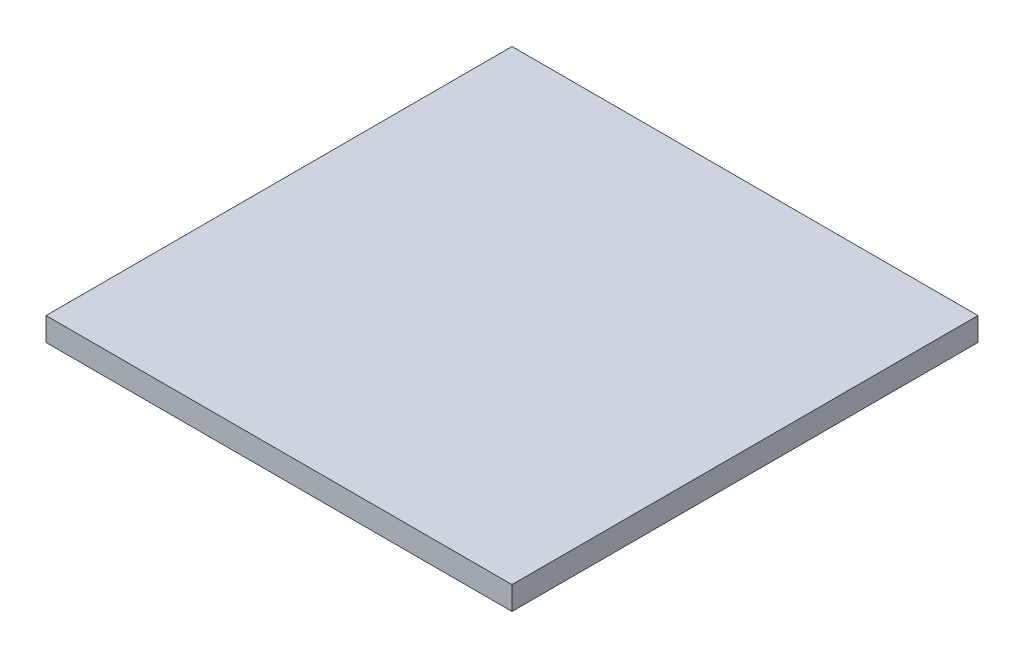
ISO-10303-21;
HEADER;
FILE_DESCRIPTION(('STEP AP214'),'2;1');
FILE_NAME('part.step','',(''),(''),'','','');
FILE_SCHEMA(('AUTOMOTIVE_DESIGN { 1 0 10303 214 1 1 1 1 }'));
ENDSEC;
DATA;
#1=APPLICATION_CONTEXT('core data for automotive mechanical design processes');
#2=APPLICATION_PROTOCOL_DEFINITION('international standard','automotive_design',2000,#1);
#3=PRODUCT_CONTEXT('',#1,'mechanical');
#4=PRODUCT('Part','Part','',(#3));
#5=PRODUCT_RELATED_PRODUCT_CATEGORY('part','',(#4));
#6=PRODUCT_DEFINITION_FORMATION('','',#4);
#7=PRODUCT_DEFINITION_CONTEXT('part definition',#1,'design');
#8=PRODUCT_DEFINITION('design','',#6,#7);
#9=PRODUCT_DEFINITION_SHAPE('','',#8);
#10=(LENGTH_UNIT() NAMED_UNIT(*) SI_UNIT(.MILLI.,.METRE.));
#11=(NAMED_UNIT(*) PLANE_ANGLE_UNIT() SI_UNIT($,.RADIAN.));
#12=(NAMED_UNIT(*) SI_UNIT($,.STERADIAN.) SOLID_ANGLE_UNIT());
#13=UNCERTAINTY_MEASURE_WITH_UNIT(LENGTH_MEASURE(1.E-05),#10,'distance_accuracy_value','');
#14=(GEOMETRIC_REPRESENTATION_CONTEXT(3) GLOBAL_UNCERTAINTY_ASSIGNED_CONTEXT((#13)) GLOBAL_UNIT_ASSIGNED_CONTEXT((#10,
#11,#12)) REPRESENTATION_CONTEXT('',''));
#15=CARTESIAN_POINT('',(0.,0.,0.));
#16=DIRECTION('',(0.,0.,1.));
#17=DIRECTION('',(1.,0.,0.));
#18=AXIS2_PLACEMENT_3D('',#15,#16,#17);
#19=CARTESIAN_POINT('',(0.,0.,60.));
#20=DIRECTION('',(1.,0.,0.));
#21=DIRECTION('',(0.,0.,-1.));
#22=AXIS2_PLACEMENT_3D('',#19,#20,#21);
#23=PLANE('',#22);
#24=DIRECTION('',(0.,-1.,0.));
#25=VECTOR('',#24,1.);
#26=CARTESIAN_POINT('',(0.,0.,0.));
#27=LINE('',#26,#25);
#28=CARTESIAN_POINT('',(0.,3.,0.));
#29=VERTEX_POINT('',#28);
#30=CARTESIAN_POINT('',(0.,0.,0.));
#31=VERTEX_POINT('',#30);
#32=EDGE_CURVE('E99',#29,#31,#27,.T.);
#33=ORIENTED_EDGE('',*,*,#32,.T.);
#34=DIRECTION('',(0.,0.,-1.));
#35=VECTOR('',#34,1.);
#36=CARTESIAN_POINT('',(0.,0.,60.));
#37=LINE('',#36,#35);
#38=CARTESIAN_POINT('',(0.,0.,60.));
#39=VERTEX_POINT('',#38);
#40=EDGE_CURVE('E11',#39,#31,#37,.T.);
#41=ORIENTED_EDGE('',*,*,#40,.F.);
#42=DIRECTION('',(0.,-1.,0.));
#43=VECTOR('',#42,1.);
#44=CARTESIAN_POINT('',(0.,0.,60.));
#45=LINE('',#44,#43);
#46=CARTESIAN_POINT('',(0.,3.,60.));
#47=VERTEX_POINT('',#46);
#48=EDGE_CURVE('E87',#47,#39,#45,.T.);
#49=ORIENTED_EDGE('',*,*,#48,.F.);
#50=DIRECTION('',(0.,0.,-1.));
#51=VECTOR('',#50,1.);
#52=CARTESIAN_POINT('',(0.,3.,60.));
#53=LINE('',#52,#51);
#54=EDGE_CURVE('E95',#47,#29,#53,.T.);
#55=ORIENTED_EDGE('',*,*,#54,.T.);
#56=EDGE_LOOP('',(#33,#41,#49,#55));
#57=FACE_BOUND('',#56,.T.);
#58=ADVANCED_FACE('F36',(#57),#23,.F.);
#59=CARTESIAN_POINT('',(0.,0.,60.));
#60=DIRECTION('',(0.,1.,0.));
#61=DIRECTION('',(0.,0.,1.));
#62=AXIS2_PLACEMENT_3D('',#59,#60,#61);
#63=PLANE('',#62);
#64=DIRECTION('',(1.,0.,0.));
#65=VECTOR('',#64,1.);
#66=CARTESIAN_POINT('',(0.,0.,0.));
#67=LINE('',#66,#65);
#68=CARTESIAN_POINT('',(60.,0.,0.));
#69=VERTEX_POINT('',#68);
#70=EDGE_CURVE('E91',#31,#69,#67,.T.);
#71=ORIENTED_EDGE('',*,*,#70,.T.);
#72=DIRECTION('',(0.,0.,-1.));
#73=VECTOR('',#72,1.);
#74=CARTESIAN_POINT('',(60.,0.,60.));
#75=LINE('',#74,#73);
#76=CARTESIAN_POINT('',(60.,0.,60.));
#77=VERTEX_POINT('',#76);
#78=EDGE_CURVE('E44',#77,#69,#75,.T.);
#79=ORIENTED_EDGE('',*,*,#78,.F.);
#80=DIRECTION('',(1.,0.,0.));
#81=VECTOR('',#80,1.);
#82=CARTESIAN_POINT('',(0.,0.,60.));
#83=LINE('',#82,#81);
#84=EDGE_CURVE('E82',#39,#77,#83,.T.);
#85=ORIENTED_EDGE('',*,*,#84,.F.);
#86=ORIENTED_EDGE('',*,*,#40,.T.);
#87=EDGE_LOOP('',(#71,#79,#85,#86));
#88=FACE_BOUND('',#87,.T.);
#89=ADVANCED_FACE('F90',(#88),#63,.F.);
#90=CARTESIAN_POINT('',(60.,0.,60.));
#91=DIRECTION('',(-1.,0.,0.));
#92=DIRECTION('',(0.,0.,1.));
#93=AXIS2_PLACEMENT_3D('',#90,#91,#92);
#94=PLANE('',#93);
#95=DIRECTION('',(0.,1.,0.));
#96=VECTOR('',#95,1.);
#97=CARTESIAN_POINT('',(60.,0.,0.));
#98=LINE('',#97,#96);
#99=CARTESIAN_POINT('',(60.,3.,0.));
#100=VERTEX_POINT('',#99);
#101=EDGE_CURVE('E69',#69,#100,#98,.T.);
#102=ORIENTED_EDGE('',*,*,#101,.T.);
#103=DIRECTION('',(0.,0.,-1.));
#104=VECTOR('',#103,1.);
#105=CARTESIAN_POINT('',(60.,3.,60.));
#106=LINE('',#105,#104);
#107=CARTESIAN_POINT('',(60.,3.,60.));
#108=VERTEX_POINT('',#107);
#109=EDGE_CURVE('E92',#108,#100,#106,.T.);
#110=ORIENTED_EDGE('',*,*,#109,.F.);
#111=DIRECTION('',(0.,1.,0.));
#112=VECTOR('',#111,1.);
#113=CARTESIAN_POINT('',(60.,0.,60.));
#114=LINE('',#113,#112);
#115=EDGE_CURVE('E85',#77,#108,#114,.T.);
#116=ORIENTED_EDGE('',*,*,#115,.F.);
#117=ORIENTED_EDGE('',*,*,#78,.T.);
#118=EDGE_LOOP('',(#102,#110,#116,#117));
#119=FACE_BOUND('',#118,.T.);
#120=ADVANCED_FACE('F93',(#119),#94,.F.);
#121=CARTESIAN_POINT('',(0.,3.,60.));
#122=DIRECTION('',(0.,-1.,0.));
#123=DIRECTION('',(0.,0.,-1.));
#124=AXIS2_PLACEMENT_3D('',#121,#122,#123);
#125=PLANE('',#124);
#126=DIRECTION('',(-1.,0.,0.));
#127=VECTOR('',#126,1.);
#128=CARTESIAN_POINT('',(0.,3.,0.));
#129=LINE('',#128,#127);
#130=EDGE_CURVE('E75',#100,#29,#129,.T.);
#131=ORIENTED_EDGE('',*,*,#130,.T.);
#132=ORIENTED_EDGE('',*,*,#54,.F.);
#133=DIRECTION('',(-1.,0.,0.));
#134=VECTOR('',#133,1.);
#135=CARTESIAN_POINT('',(0.,3.,60.));
#136=LINE('',#135,#134);
#137=EDGE_CURVE('E52',#108,#47,#136,.T.);
#138=ORIENTED_EDGE('',*,*,#137,.F.);
#139=ORIENTED_EDGE('',*,*,#109,.T.);
#140=EDGE_LOOP('',(#131,#132,#138,#139));
#141=FACE_BOUND('',#140,.T.);
#142=ADVANCED_FACE('F106',(#141),#125,.F.);
#143=CARTESIAN_POINT('',(0.,0.,60.));
#144=DIRECTION('',(0.,0.,-1.));
#145=DIRECTION('',(-1.,0.,0.));
#146=AXIS2_PLACEMENT_3D('',#143,#144,#145);
#147=PLANE('',#146);
#148=ORIENTED_EDGE('',*,*,#48,.T.);
#149=ORIENTED_EDGE('',*,*,#84,.T.);
#150=ORIENTED_EDGE('',*,*,#115,.T.);
#151=ORIENTED_EDGE('',*,*,#137,.T.);
#152=EDGE_LOOP('',(#148,#149,#150,#151));
#153=FACE_BOUND('',#152,.T.);
#154=ADVANCED_FACE('F83',(#153),#147,.F.);
#155=CARTESIAN_POINT('',(0.,0.,0.));
#156=DIRECTION('',(0.,0.,-1.));
#157=DIRECTION('',(-1.,0.,0.));
#158=AXIS2_PLACEMENT_3D('',#155,#156,#157);
#159=PLANE('',#158);
#160=ORIENTED_EDGE('',*,*,#32,.F.);
#161=ORIENTED_EDGE('',*,*,#130,.F.);
#162=ORIENTED_EDGE('',*,*,#101,.F.);
#163=ORIENTED_EDGE('',*,*,#70,.F.);
#164=EDGE_LOOP('',(#160,#161,#162,#163));
#165=FACE_BOUND('',#164,.T.);
#166=ADVANCED_FACE('F109',(#165),#159,.T.);
#167=CLOSED_SHELL('',(#58,#89,#120,#142,#154,#166));
#168=MANIFOLD_SOLID_BREP('B2',#167);
#169=ADVANCED_BREP_SHAPE_REPRESENTATION('',(#18,#168),#14);
#170=SHAPE_DEFINITION_REPRESENTATION(#9,#169);
ENDSEC;
END-ISO-10303-21;
